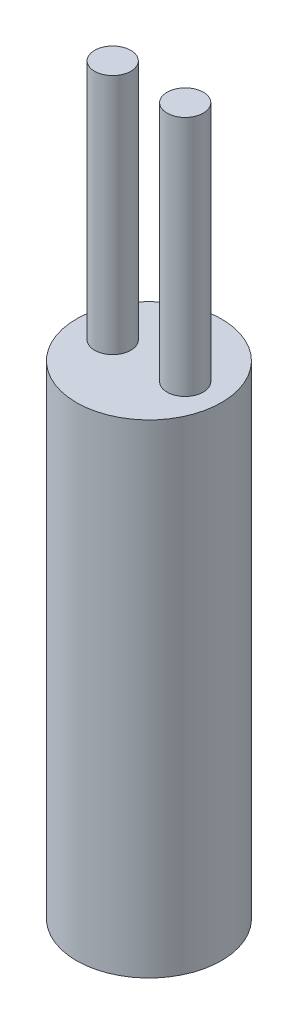
ISO-10303-21;
HEADER;
FILE_DESCRIPTION(('STEP AP214'),'2;1');
FILE_NAME('part.step','',(''),(''),'','','');
FILE_SCHEMA(('AUTOMOTIVE_DESIGN { 1 0 10303 214 1 1 1 1 }'));
ENDSEC;
DATA;
#1=APPLICATION_CONTEXT('core data for automotive mechanical design processes');
#2=APPLICATION_PROTOCOL_DEFINITION('international standard','automotive_design',2000,#1);
#3=PRODUCT_CONTEXT('',#1,'mechanical');
#4=PRODUCT('Part','Part','',(#3));
#5=PRODUCT_RELATED_PRODUCT_CATEGORY('part','',(#4));
#6=PRODUCT_DEFINITION_FORMATION('','',#4);
#7=PRODUCT_DEFINITION_CONTEXT('part definition',#1,'design');
#8=PRODUCT_DEFINITION('design','',#6,#7);
#9=PRODUCT_DEFINITION_SHAPE('','',#8);
#10=(LENGTH_UNIT() NAMED_UNIT(*) SI_UNIT(.MILLI.,.METRE.));
#11=(NAMED_UNIT(*) PLANE_ANGLE_UNIT() SI_UNIT($,.RADIAN.));
#12=(NAMED_UNIT(*) SI_UNIT($,.STERADIAN.) SOLID_ANGLE_UNIT());
#13=UNCERTAINTY_MEASURE_WITH_UNIT(LENGTH_MEASURE(1.E-05),#10,'distance_accuracy_value','');
#14=(GEOMETRIC_REPRESENTATION_CONTEXT(3) GLOBAL_UNCERTAINTY_ASSIGNED_CONTEXT((#13)) GLOBAL_UNIT_ASSIGNED_CONTEXT((#10,
#11,#12)) REPRESENTATION_CONTEXT('',''));
#15=CARTESIAN_POINT('',(0.,0.,0.));
#16=DIRECTION('',(0.,0.,1.));
#17=DIRECTION('',(1.,0.,0.));
#18=AXIS2_PLACEMENT_3D('',#15,#16,#17);
#19=CARTESIAN_POINT('',(0.,20.,0.));
#20=DIRECTION('',(0.,-1.,0.));
#21=DIRECTION('',(0.,0.,-1.));
#22=AXIS2_PLACEMENT_3D('',#19,#20,#21);
#23=CYLINDRICAL_SURFACE('',#22,3.);
#24=CARTESIAN_POINT('',(0.,20.,0.));
#25=DIRECTION('',(0.,1.,0.));
#26=DIRECTION('',(0.,0.,1.));
#27=AXIS2_PLACEMENT_3D('',#24,#25,#26);
#28=CIRCLE('',#27,3.);
#29=CARTESIAN_POINT('',(0.,20.,3.));
#30=VERTEX_POINT('',#29);
#31=EDGE_CURVE('E10',#30,#30,#28,.T.);
#32=ORIENTED_EDGE('',*,*,#31,.F.);
#33=EDGE_LOOP('',(#32));
#34=FACE_BOUND('',#33,.T.);
#35=CARTESIAN_POINT('',(0.,0.,0.));
#36=DIRECTION('',(0.,1.,0.));
#37=DIRECTION('',(0.,0.,1.));
#38=AXIS2_PLACEMENT_3D('',#35,#36,#37);
#39=CIRCLE('',#38,3.);
#40=CARTESIAN_POINT('',(0.,0.,3.));
#41=VERTEX_POINT('',#40);
#42=EDGE_CURVE('E35',#41,#41,#39,.T.);
#43=ORIENTED_EDGE('',*,*,#42,.T.);
#44=EDGE_LOOP('',(#43));
#45=FACE_BOUND('',#44,.T.);
#46=ADVANCED_FACE('F32',(#34,#45),#23,.T.);
#47=CARTESIAN_POINT('',(0.,20.,0.));
#48=DIRECTION('',(0.,1.,0.));
#49=DIRECTION('',(0.,0.,1.));
#50=AXIS2_PLACEMENT_3D('',#47,#48,#49);
#51=PLANE('',#50);
#52=CARTESIAN_POINT('',(-1.5,20.,0.));
#53=DIRECTION('',(0.,1.,0.));
#54=DIRECTION('',(0.,0.,-1.));
#55=AXIS2_PLACEMENT_3D('',#52,#53,#54);
#56=CIRCLE('',#55,0.75);
#57=CARTESIAN_POINT('',(-1.5,20.,-0.749999999999999));
#58=VERTEX_POINT('',#57);
#59=EDGE_CURVE('E50',#58,#58,#56,.T.);
#60=ORIENTED_EDGE('',*,*,#59,.F.);
#61=EDGE_LOOP('',(#60));
#62=FACE_BOUND('',#61,.T.);
#63=CARTESIAN_POINT('',(1.5,20.,0.));
#64=DIRECTION('',(0.,1.,0.));
#65=DIRECTION('',(0.,0.,1.));
#66=AXIS2_PLACEMENT_3D('',#63,#64,#65);
#67=CIRCLE('',#66,0.75);
#68=CARTESIAN_POINT('',(1.5,20.,0.750000000000002));
#69=VERTEX_POINT('',#68);
#70=EDGE_CURVE('E44',#69,#69,#67,.T.);
#71=ORIENTED_EDGE('',*,*,#70,.F.);
#72=EDGE_LOOP('',(#71));
#73=FACE_BOUND('',#72,.T.);
#74=ORIENTED_EDGE('',*,*,#31,.T.);
#75=EDGE_LOOP('',(#74));
#76=FACE_BOUND('',#75,.T.);
#77=ADVANCED_FACE('F65',(#62,#73,#76),#51,.T.);
#78=CARTESIAN_POINT('',(0.,0.,0.));
#79=DIRECTION('',(0.,1.,0.));
#80=DIRECTION('',(0.,0.,1.));
#81=AXIS2_PLACEMENT_3D('',#78,#79,#80);
#82=PLANE('',#81);
#83=ORIENTED_EDGE('',*,*,#42,.F.);
#84=EDGE_LOOP('',(#83));
#85=FACE_BOUND('',#84,.T.);
#86=ADVANCED_FACE('F68',(#85),#82,.F.);
#87=CARTESIAN_POINT('',(1.5,30.,0.));
#88=DIRECTION('',(0.,-1.,0.));
#89=DIRECTION('',(0.,0.,-1.));
#90=AXIS2_PLACEMENT_3D('',#87,#88,#89);
#91=CYLINDRICAL_SURFACE('',#90,0.75);
#92=CARTESIAN_POINT('',(1.5,30.,0.));
#93=DIRECTION('',(0.,1.,0.));
#94=DIRECTION('',(0.,0.,1.));
#95=AXIS2_PLACEMENT_3D('',#92,#93,#94);
#96=CIRCLE('',#95,0.75);
#97=CARTESIAN_POINT('',(1.5,30.,0.750000000000002));
#98=VERTEX_POINT('',#97);
#99=EDGE_CURVE('E42',#98,#98,#96,.T.);
#100=ORIENTED_EDGE('',*,*,#99,.F.);
#101=EDGE_LOOP('',(#100));
#102=FACE_BOUND('',#101,.T.);
#103=ORIENTED_EDGE('',*,*,#70,.T.);
#104=EDGE_LOOP('',(#103));
#105=FACE_BOUND('',#104,.T.);
#106=ADVANCED_FACE('F72',(#102,#105),#91,.T.);
#107=CARTESIAN_POINT('',(1.5,30.,0.));
#108=DIRECTION('',(0.,1.,0.));
#109=DIRECTION('',(0.,0.,1.));
#110=AXIS2_PLACEMENT_3D('',#107,#108,#109);
#111=PLANE('',#110);
#112=ORIENTED_EDGE('',*,*,#99,.T.);
#113=EDGE_LOOP('',(#112));
#114=FACE_BOUND('',#113,.T.);
#115=ADVANCED_FACE('F61',(#114),#111,.T.);
#116=CARTESIAN_POINT('',(-1.5,30.,0.));
#117=DIRECTION('',(0.,-1.,0.));
#118=DIRECTION('',(0.,0.,-1.));
#119=AXIS2_PLACEMENT_3D('',#116,#117,#118);
#120=CYLINDRICAL_SURFACE('',#119,0.75);
#121=CARTESIAN_POINT('',(-1.5,30.,0.));
#122=DIRECTION('',(0.,1.,0.));
#123=DIRECTION('',(0.,0.,-1.));
#124=AXIS2_PLACEMENT_3D('',#121,#122,#123);
#125=CIRCLE('',#124,0.75);
#126=CARTESIAN_POINT('',(-1.5,30.,-0.749999999999999));
#127=VERTEX_POINT('',#126);
#128=EDGE_CURVE('E47',#127,#127,#125,.T.);
#129=ORIENTED_EDGE('',*,*,#128,.F.);
#130=EDGE_LOOP('',(#129));
#131=FACE_BOUND('',#130,.T.);
#132=ORIENTED_EDGE('',*,*,#59,.T.);
#133=EDGE_LOOP('',(#132));
#134=FACE_BOUND('',#133,.T.);
#135=ADVANCED_FACE('F58',(#131,#134),#120,.T.);
#136=CARTESIAN_POINT('',(-1.5,30.,0.));
#137=DIRECTION('',(0.,-1.,0.));
#138=DIRECTION('',(0.,0.,-1.));
#139=AXIS2_PLACEMENT_3D('',#136,#137,#138);
#140=PLANE('',#139);
#141=ORIENTED_EDGE('',*,*,#128,.T.);
#142=EDGE_LOOP('',(#141));
#143=FACE_BOUND('',#142,.T.);
#144=ADVANCED_FACE('F56',(#143),#140,.F.);
#145=CLOSED_SHELL('',(#46,#77,#86,#106,#115,#135,#144));
#146=MANIFOLD_SOLID_BREP('B2',#145);
#147=ADVANCED_BREP_SHAPE_REPRESENTATION('',(#18,#146),#14);
#148=SHAPE_DEFINITION_REPRESENTATION(#9,#147);
ENDSEC;
END-ISO-10303-21;
